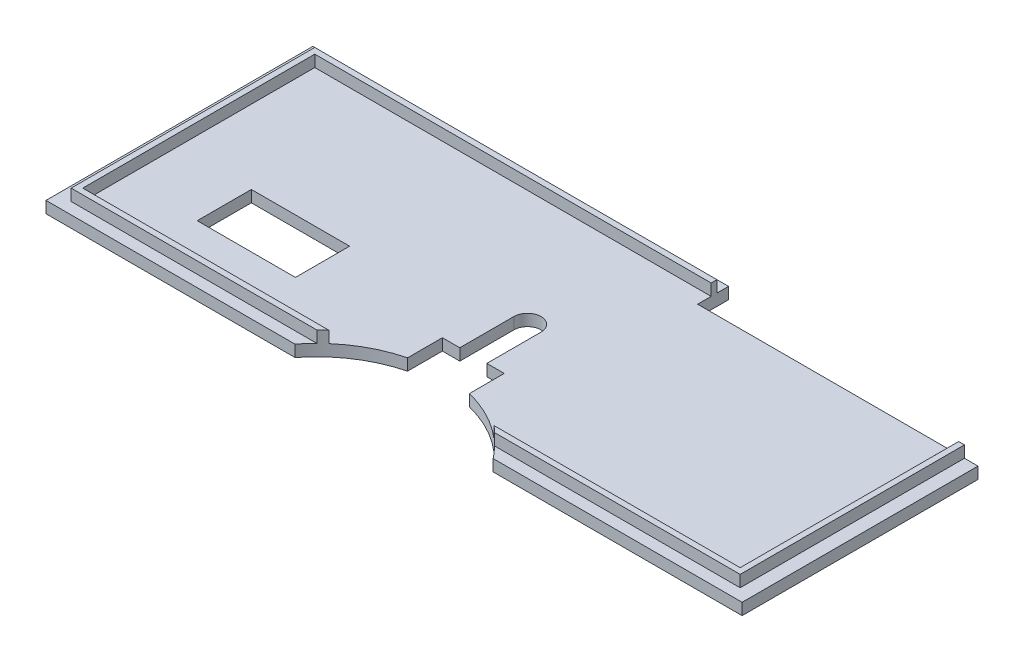
ISO-10303-21;
HEADER;
FILE_DESCRIPTION(('STEP AP214'),'2;1');
FILE_NAME('part.step','',(''),(''),'','','');
FILE_SCHEMA(('AUTOMOTIVE_DESIGN { 1 0 10303 214 1 1 1 1 }'));
ENDSEC;
DATA;
#1=APPLICATION_CONTEXT('core data for automotive mechanical design processes');
#2=APPLICATION_PROTOCOL_DEFINITION('international standard','automotive_design',2000,#1);
#3=PRODUCT_CONTEXT('',#1,'mechanical');
#4=PRODUCT('Part','Part','',(#3));
#5=PRODUCT_RELATED_PRODUCT_CATEGORY('part','',(#4));
#6=PRODUCT_DEFINITION_FORMATION('','',#4);
#7=PRODUCT_DEFINITION_CONTEXT('part definition',#1,'design');
#8=PRODUCT_DEFINITION('design','',#6,#7);
#9=PRODUCT_DEFINITION_SHAPE('','',#8);
#10=(LENGTH_UNIT() NAMED_UNIT(*) SI_UNIT(.MILLI.,.METRE.));
#11=(NAMED_UNIT(*) PLANE_ANGLE_UNIT() SI_UNIT($,.RADIAN.));
#12=(NAMED_UNIT(*) SI_UNIT($,.STERADIAN.) SOLID_ANGLE_UNIT());
#13=UNCERTAINTY_MEASURE_WITH_UNIT(LENGTH_MEASURE(1.E-05),#10,'distance_accuracy_value','');
#14=(GEOMETRIC_REPRESENTATION_CONTEXT(3) GLOBAL_UNCERTAINTY_ASSIGNED_CONTEXT((#13)) GLOBAL_UNIT_ASSIGNED_CONTEXT((#10,
#11,#12)) REPRESENTATION_CONTEXT('',''));
#15=CARTESIAN_POINT('',(0.,0.,0.));
#16=DIRECTION('',(0.,0.,1.));
#17=DIRECTION('',(1.,0.,0.));
#18=AXIS2_PLACEMENT_3D('',#15,#16,#17);
#19=CARTESIAN_POINT('',(8.,10.,14.));
#20=DIRECTION('',(0.,0.,-1.));
#21=DIRECTION('',(-1.,0.,0.));
#22=AXIS2_PLACEMENT_3D('',#19,#20,#21);
#23=PLANE('',#22);
#24=DIRECTION('',(1.,0.,0.));
#25=VECTOR('',#24,1.);
#26=CARTESIAN_POINT('',(8.,0.,14.));
#27=LINE('',#26,#25);
#28=CARTESIAN_POINT('',(-8.,0.,14.));
#29=VERTEX_POINT('',#28);
#30=CARTESIAN_POINT('',(-3.5,0.,14.));
#31=VERTEX_POINT('',#30);
#32=EDGE_CURVE('E525',#29,#31,#27,.T.);
#33=ORIENTED_EDGE('',*,*,#32,.T.);
#34=DIRECTION('',(0.,1.,0.));
#35=VECTOR('',#34,1.);
#36=CARTESIAN_POINT('',(-3.5,10.,14.));
#37=LINE('',#36,#35);
#38=CARTESIAN_POINT('',(-3.5,3.,14.));
#39=VERTEX_POINT('',#38);
#40=EDGE_CURVE('E11',#31,#39,#37,.T.);
#41=ORIENTED_EDGE('',*,*,#40,.T.);
#42=DIRECTION('',(1.,0.,0.));
#43=VECTOR('',#42,1.);
#44=CARTESIAN_POINT('',(0.,3.,14.));
#45=LINE('',#44,#43);
#46=CARTESIAN_POINT('',(-8.,3.,14.));
#47=VERTEX_POINT('',#46);
#48=EDGE_CURVE('E506',#47,#39,#45,.T.);
#49=ORIENTED_EDGE('',*,*,#48,.F.);
#50=DIRECTION('',(0.,-1.,0.));
#51=VECTOR('',#50,1.);
#52=CARTESIAN_POINT('',(-8.,10.,14.));
#53=LINE('',#52,#51);
#54=EDGE_CURVE('E537',#47,#29,#53,.T.);
#55=ORIENTED_EDGE('',*,*,#54,.T.);
#56=EDGE_LOOP('',(#33,#41,#49,#55));
#57=FACE_BOUND('',#56,.T.);
#58=ADVANCED_FACE('F43',(#57),#23,.F.);
#59=CARTESIAN_POINT('',(0.,3.,0.));
#60=DIRECTION('',(0.,-1.,0.));
#61=DIRECTION('',(0.,0.,-1.));
#62=AXIS2_PLACEMENT_3D('',#59,#60,#61);
#63=PLANE('',#62);
#64=DIRECTION('',(0.,0.,-1.));
#65=VECTOR('',#64,1.);
#66=CARTESIAN_POINT('',(90.,3.,-34.5));
#67=LINE('',#66,#65);
#68=CARTESIAN_POINT('',(90.,3.,34.5));
#69=VERTEX_POINT('',#68);
#70=CARTESIAN_POINT('',(90.,3.,-26.5));
#71=VERTEX_POINT('',#70);
#72=EDGE_CURVE('E443',#69,#71,#67,.T.);
#73=ORIENTED_EDGE('',*,*,#72,.T.);
#74=DIRECTION('',(1.,0.,0.));
#75=VECTOR('',#74,1.);
#76=CARTESIAN_POINT('',(90.,3.,-26.5));
#77=LINE('',#76,#75);
#78=CARTESIAN_POINT('',(86.5,3.,-26.5));
#79=VERTEX_POINT('',#78);
#80=EDGE_CURVE('E625',#79,#71,#77,.T.);
#81=ORIENTED_EDGE('',*,*,#80,.F.);
#82=DIRECTION('',(0.,0.,-1.));
#83=VECTOR('',#82,1.);
#84=CARTESIAN_POINT('',(86.5,3.,-31.5));
#85=LINE('',#84,#83);
#86=CARTESIAN_POINT('',(86.5,3.,31.5));
#87=VERTEX_POINT('',#86);
#88=EDGE_CURVE('E415',#87,#79,#85,.T.);
#89=ORIENTED_EDGE('',*,*,#88,.F.);
#90=DIRECTION('',(1.,0.,0.));
#91=VECTOR('',#90,1.);
#92=CARTESIAN_POINT('',(86.5,3.,31.5));
#93=LINE('',#92,#91);
#94=CARTESIAN_POINT('',(22.96192500641,3.,31.5));
#95=VERTEX_POINT('',#94);
#96=EDGE_CURVE('E410',#95,#87,#93,.T.);
#97=ORIENTED_EDGE('',*,*,#96,.F.);
#98=CARTESIAN_POINT('',(0.,3.,54.5));
#99=DIRECTION('',(0.,-1.,0.));
#100=DIRECTION('',(0.,0.,-1.));
#101=AXIS2_PLACEMENT_3D('',#98,#99,#100);
#102=CIRCLE('',#101,32.5);
#103=CARTESIAN_POINT('',(25.617376914899,3.,34.5));
#104=VERTEX_POINT('',#103);
#105=EDGE_CURVE('E294',#95,#104,#102,.T.);
#106=ORIENTED_EDGE('',*,*,#105,.T.);
#107=DIRECTION('',(1.,0.,0.));
#108=VECTOR('',#107,1.);
#109=CARTESIAN_POINT('',(90.,3.,34.5));
#110=LINE('',#109,#108);
#111=EDGE_CURVE('E437',#104,#69,#110,.T.);
#112=ORIENTED_EDGE('',*,*,#111,.T.);
#113=EDGE_LOOP('',(#73,#81,#89,#97,#106,#112));
#114=FACE_BOUND('',#113,.T.);
#115=ADVANCED_FACE('F623',(#114),#63,.F.);
#116=DIRECTION('',(0.,0.,-1.));
#117=VECTOR('',#116,1.);
#118=CARTESIAN_POINT('',(-40.5,3.,0.));
#119=LINE('',#118,#117);
#120=CARTESIAN_POINT('',(-40.5,3.,19.5));
#121=VERTEX_POINT('',#120);
#122=CARTESIAN_POINT('',(-40.5,3.,5.50000000000001));
#123=VERTEX_POINT('',#122);
#124=EDGE_CURVE('E487',#121,#123,#119,.T.);
#125=ORIENTED_EDGE('',*,*,#124,.F.);
#126=DIRECTION('',(-1.,0.,0.));
#127=VECTOR('',#126,1.);
#128=CARTESIAN_POINT('',(0.,3.,19.5));
#129=LINE('',#128,#127);
#130=CARTESIAN_POINT('',(-65.9,3.,19.5));
#131=VERTEX_POINT('',#130);
#132=EDGE_CURVE('E476',#121,#131,#129,.T.);
#133=ORIENTED_EDGE('',*,*,#132,.T.);
#134=DIRECTION('',(0.,0.,-1.));
#135=VECTOR('',#134,1.);
#136=CARTESIAN_POINT('',(-65.9,3.,0.));
#137=LINE('',#136,#135);
#138=CARTESIAN_POINT('',(-65.9,3.,5.50000000000001));
#139=VERTEX_POINT('',#138);
#140=EDGE_CURVE('E480',#131,#139,#137,.T.);
#141=ORIENTED_EDGE('',*,*,#140,.T.);
#142=DIRECTION('',(-1.,0.,0.));
#143=VECTOR('',#142,1.);
#144=CARTESIAN_POINT('',(0.,3.,5.5));
#145=LINE('',#144,#143);
#146=EDGE_CURVE('E484',#123,#139,#145,.T.);
#147=ORIENTED_EDGE('',*,*,#146,.F.);
#148=EDGE_LOOP('',(#125,#133,#141,#147));
#149=FACE_BOUND('',#148,.T.);
#150=ORIENTED_EDGE('',*,*,#48,.T.);
#151=DIRECTION('',(0.,0.,-1.));
#152=VECTOR('',#151,1.);
#153=CARTESIAN_POINT('',(-3.5,3.,0.));
#154=LINE('',#153,#152);
#155=CARTESIAN_POINT('',(-3.5,3.,0.));
#156=VERTEX_POINT('',#155);
#157=EDGE_CURVE('E59',#39,#156,#154,.T.);
#158=ORIENTED_EDGE('',*,*,#157,.T.);
#159=CARTESIAN_POINT('',(0.,3.,0.));
#160=DIRECTION('',(0.,-1.,0.));
#161=DIRECTION('',(0.,0.,-1.));
#162=AXIS2_PLACEMENT_3D('',#159,#160,#161);
#163=CIRCLE('',#162,3.5);
#164=CARTESIAN_POINT('',(3.5,3.,0.));
#165=VERTEX_POINT('',#164);
#166=EDGE_CURVE('E279',#156,#165,#163,.T.);
#167=ORIENTED_EDGE('',*,*,#166,.T.);
#168=DIRECTION('',(0.,0.,1.));
#169=VECTOR('',#168,1.);
#170=CARTESIAN_POINT('',(3.5,3.,0.));
#171=LINE('',#170,#169);
#172=CARTESIAN_POINT('',(3.5,3.,14.));
#173=VERTEX_POINT('',#172);
#174=EDGE_CURVE('E608',#165,#173,#171,.T.);
#175=ORIENTED_EDGE('',*,*,#174,.T.);
#176=CARTESIAN_POINT('',(8.,3.,14.));
#177=VERTEX_POINT('',#176);
#178=EDGE_CURVE('E505',#173,#177,#45,.T.);
#179=ORIENTED_EDGE('',*,*,#178,.T.);
#180=DIRECTION('',(0.,0.,1.));
#181=VECTOR('',#180,1.);
#182=CARTESIAN_POINT('',(8.,3.,0.));
#183=LINE('',#182,#181);
#184=CARTESIAN_POINT('',(8.,3.,23.));
#185=VERTEX_POINT('',#184);
#186=EDGE_CURVE('E541',#177,#185,#183,.T.);
#187=ORIENTED_EDGE('',*,*,#186,.T.);
#188=CARTESIAN_POINT('',(21.3541565040626,3.,30.));
#189=VERTEX_POINT('',#188);
#190=EDGE_CURVE('E560',#185,#189,#102,.T.);
#191=ORIENTED_EDGE('',*,*,#190,.T.);
#192=DIRECTION('',(1.,0.,0.));
#193=VECTOR('',#192,1.);
#194=CARTESIAN_POINT('',(85.,3.,30.));
#195=LINE('',#194,#193);
#196=CARTESIAN_POINT('',(85.,3.,30.));
#197=VERTEX_POINT('',#196);
#198=EDGE_CURVE('E366',#189,#197,#195,.T.);
#199=ORIENTED_EDGE('',*,*,#198,.T.);
#200=DIRECTION('',(0.,0.,-1.));
#201=VECTOR('',#200,1.);
#202=CARTESIAN_POINT('',(85.,3.,-30.));
#203=LINE('',#202,#201);
#204=CARTESIAN_POINT('',(85.,3.,-26.5));
#205=VERTEX_POINT('',#204);
#206=EDGE_CURVE('E371',#197,#205,#203,.T.);
#207=ORIENTED_EDGE('',*,*,#206,.T.);
#208=CARTESIAN_POINT('',(17.5,3.,-26.5));
#209=VERTEX_POINT('',#208);
#210=EDGE_CURVE('E629',#209,#205,#77,.T.);
#211=ORIENTED_EDGE('',*,*,#210,.F.);
#212=DIRECTION('',(0.,0.,1.));
#213=VECTOR('',#212,1.);
#214=CARTESIAN_POINT('',(17.5,3.,-34.5));
#215=LINE('',#214,#213);
#216=CARTESIAN_POINT('',(17.5,3.,-30.));
#217=VERTEX_POINT('',#216);
#218=EDGE_CURVE('E650',#217,#209,#215,.T.);
#219=ORIENTED_EDGE('',*,*,#218,.F.);
#220=DIRECTION('',(-1.,0.,0.));
#221=VECTOR('',#220,1.);
#222=CARTESIAN_POINT('',(85.,3.,-30.));
#223=LINE('',#222,#221);
#224=CARTESIAN_POINT('',(-85.,3.,-30.));
#225=VERTEX_POINT('',#224);
#226=EDGE_CURVE('E350',#217,#225,#223,.T.);
#227=ORIENTED_EDGE('',*,*,#226,.T.);
#228=DIRECTION('',(0.,0.,1.));
#229=VECTOR('',#228,1.);
#230=CARTESIAN_POINT('',(-85.,3.,-30.));
#231=LINE('',#230,#229);
#232=CARTESIAN_POINT('',(-85.,3.,30.));
#233=VERTEX_POINT('',#232);
#234=EDGE_CURVE('E336',#225,#233,#231,.T.);
#235=ORIENTED_EDGE('',*,*,#234,.T.);
#236=CARTESIAN_POINT('',(-21.3541565040626,3.,30.));
#237=VERTEX_POINT('',#236);
#238=EDGE_CURVE('E367',#233,#237,#195,.T.);
#239=ORIENTED_EDGE('',*,*,#238,.T.);
#240=CARTESIAN_POINT('',(-8.,3.,23.));
#241=VERTEX_POINT('',#240);
#242=EDGE_CURVE('E562',#237,#241,#102,.T.);
#243=ORIENTED_EDGE('',*,*,#242,.T.);
#244=DIRECTION('',(0.,0.,-1.));
#245=VECTOR('',#244,1.);
#246=CARTESIAN_POINT('',(-8.,3.,0.));
#247=LINE('',#246,#245);
#248=EDGE_CURVE('E547',#241,#47,#247,.T.);
#249=ORIENTED_EDGE('',*,*,#248,.T.);
#250=EDGE_LOOP('',(#150,#158,#167,#175,#179,#187,#191,#199,#207,#211,#219,#227,#235,#239,#243,#249));
#251=FACE_BOUND('',#250,.T.);
#252=ADVANCED_FACE('F589',(#149,#251),#63,.F.);
#253=CARTESIAN_POINT('',(0.,10.,54.5));
#254=DIRECTION('',(0.,-1.,0.));
#255=DIRECTION('',(0.,0.,-1.));
#256=AXIS2_PLACEMENT_3D('',#253,#254,#255);
#257=CYLINDRICAL_SURFACE('',#256,32.5);
#258=CARTESIAN_POINT('',(0.,0.,54.5));
#259=DIRECTION('',(0.,-1.,0.));
#260=DIRECTION('',(0.,0.,-1.));
#261=AXIS2_PLACEMENT_3D('',#258,#259,#260);
#262=CIRCLE('',#261,32.5);
#263=CARTESIAN_POINT('',(-25.617376914899,0.,34.5));
#264=VERTEX_POINT('',#263);
#265=CARTESIAN_POINT('',(-8.,0.,23.));
#266=VERTEX_POINT('',#265);
#267=EDGE_CURVE('E552',#264,#266,#262,.T.);
#268=ORIENTED_EDGE('',*,*,#267,.T.);
#269=DIRECTION('',(0.,-1.,0.));
#270=VECTOR('',#269,1.);
#271=CARTESIAN_POINT('',(-8.,10.,23.));
#272=LINE('',#271,#270);
#273=EDGE_CURVE('E501',#266,#241,#272,.F.);
#274=ORIENTED_EDGE('',*,*,#273,.T.);
#275=ORIENTED_EDGE('',*,*,#242,.F.);
#276=DIRECTION('',(0.,-1.,0.));
#277=VECTOR('',#276,1.);
#278=CARTESIAN_POINT('',(-21.3541565040626,10.,30.));
#279=LINE('',#278,#277);
#280=CARTESIAN_POINT('',(-21.3541565040626,6.,30.));
#281=VERTEX_POINT('',#280);
#282=EDGE_CURVE('E490',#237,#281,#279,.F.);
#283=ORIENTED_EDGE('',*,*,#282,.T.);
#284=CARTESIAN_POINT('',(0.,6.,54.5));
#285=DIRECTION('',(0.,-1.,0.));
#286=DIRECTION('',(0.,0.,-1.));
#287=AXIS2_PLACEMENT_3D('',#284,#285,#286);
#288=CIRCLE('',#287,32.5);
#289=CARTESIAN_POINT('',(-22.96192500641,6.,31.5));
#290=VERTEX_POINT('',#289);
#291=EDGE_CURVE('E556',#290,#281,#288,.T.);
#292=ORIENTED_EDGE('',*,*,#291,.F.);
#293=DIRECTION('',(0.,-1.,0.));
#294=VECTOR('',#293,1.);
#295=CARTESIAN_POINT('',(-22.9619250064101,10.,31.5));
#296=LINE('',#295,#294);
#297=CARTESIAN_POINT('',(-22.9619250064101,3.,31.5));
#298=VERTEX_POINT('',#297);
#299=EDGE_CURVE('E566',#298,#290,#296,.F.);
#300=ORIENTED_EDGE('',*,*,#299,.F.);
#301=CARTESIAN_POINT('',(-25.617376914899,3.,34.5));
#302=VERTEX_POINT('',#301);
#303=EDGE_CURVE('E567',#302,#298,#102,.T.);
#304=ORIENTED_EDGE('',*,*,#303,.F.);
#305=DIRECTION('',(0.,-1.,0.));
#306=VECTOR('',#305,1.);
#307=CARTESIAN_POINT('',(-25.617376914899,10.,34.5));
#308=LINE('',#307,#306);
#309=EDGE_CURVE('E575',#264,#302,#308,.F.);
#310=ORIENTED_EDGE('',*,*,#309,.F.);
#311=EDGE_LOOP('',(#268,#274,#275,#283,#292,#300,#304,#310));
#312=FACE_BOUND('',#311,.T.);
#313=ADVANCED_FACE('F717',(#312),#257,.F.);
#314=CARTESIAN_POINT('',(90.,3.,34.5));
#315=DIRECTION('',(0.,0.,-1.));
#316=DIRECTION('',(-1.,0.,0.));
#317=AXIS2_PLACEMENT_3D('',#314,#315,#316);
#318=PLANE('',#317);
#319=ORIENTED_EDGE('',*,*,#111,.F.);
#320=DIRECTION('',(0.,-1.,0.));
#321=VECTOR('',#320,1.);
#322=CARTESIAN_POINT('',(25.617376914899,10.,34.5));
#323=LINE('',#322,#321);
#324=CARTESIAN_POINT('',(25.617376914899,0.,34.5));
#325=VERTEX_POINT('',#324);
#326=EDGE_CURVE('E287',#104,#325,#323,.T.);
#327=ORIENTED_EDGE('',*,*,#326,.T.);
#328=DIRECTION('',(1.,0.,0.));
#329=VECTOR('',#328,1.);
#330=CARTESIAN_POINT('',(90.,0.,34.5));
#331=LINE('',#330,#329);
#332=CARTESIAN_POINT('',(90.,0.,34.5));
#333=VERTEX_POINT('',#332);
#334=EDGE_CURVE('E454',#325,#333,#331,.T.);
#335=ORIENTED_EDGE('',*,*,#334,.T.);
#336=DIRECTION('',(0.,-1.,0.));
#337=VECTOR('',#336,1.);
#338=CARTESIAN_POINT('',(90.,3.,34.5));
#339=LINE('',#338,#337);
#340=EDGE_CURVE('E468',#69,#333,#339,.T.);
#341=ORIENTED_EDGE('',*,*,#340,.F.);
#342=EDGE_LOOP('',(#319,#327,#335,#341));
#343=FACE_BOUND('',#342,.T.);
#344=ADVANCED_FACE('F617',(#343),#318,.F.);
#345=CARTESIAN_POINT('',(0.,6.,0.));
#346=DIRECTION('',(0.,-1.,0.));
#347=DIRECTION('',(0.,0.,-1.));
#348=AXIS2_PLACEMENT_3D('',#345,#346,#347);
#349=PLANE('',#348);
#350=DIRECTION('',(1.,0.,0.));
#351=VECTOR('',#350,1.);
#352=CARTESIAN_POINT('',(85.,6.,30.));
#353=LINE('',#352,#351);
#354=CARTESIAN_POINT('',(21.3541565040626,6.,30.));
#355=VERTEX_POINT('',#354);
#356=CARTESIAN_POINT('',(85.,6.,30.));
#357=VERTEX_POINT('',#356);
#358=EDGE_CURVE('E349',#355,#357,#353,.T.);
#359=ORIENTED_EDGE('',*,*,#358,.F.);
#360=CARTESIAN_POINT('',(22.96192500641,6.,31.5));
#361=VERTEX_POINT('',#360);
#362=EDGE_CURVE('E561',#355,#361,#288,.T.);
#363=ORIENTED_EDGE('',*,*,#362,.T.);
#364=DIRECTION('',(1.,0.,0.));
#365=VECTOR('',#364,1.);
#366=CARTESIAN_POINT('',(86.5,6.,31.5));
#367=LINE('',#366,#365);
#368=CARTESIAN_POINT('',(86.5,6.,31.5));
#369=VERTEX_POINT('',#368);
#370=EDGE_CURVE('E393',#361,#369,#367,.T.);
#371=ORIENTED_EDGE('',*,*,#370,.T.);
#372=DIRECTION('',(0.,0.,-1.));
#373=VECTOR('',#372,1.);
#374=CARTESIAN_POINT('',(86.5,6.,-31.5));
#375=LINE('',#374,#373);
#376=CARTESIAN_POINT('',(86.5,6.,-26.5));
#377=VERTEX_POINT('',#376);
#378=EDGE_CURVE('E399',#369,#377,#375,.T.);
#379=ORIENTED_EDGE('',*,*,#378,.T.);
#380=DIRECTION('',(1.,0.,0.));
#381=VECTOR('',#380,1.);
#382=CARTESIAN_POINT('',(86.5,6.,-26.5));
#383=LINE('',#382,#381);
#384=CARTESIAN_POINT('',(85.,6.,-26.5));
#385=VERTEX_POINT('',#384);
#386=EDGE_CURVE('E291',#385,#377,#383,.T.);
#387=ORIENTED_EDGE('',*,*,#386,.F.);
#388=DIRECTION('',(0.,0.,-1.));
#389=VECTOR('',#388,1.);
#390=CARTESIAN_POINT('',(85.,6.,-30.));
#391=LINE('',#390,#389);
#392=EDGE_CURVE('E355',#357,#385,#391,.T.);
#393=ORIENTED_EDGE('',*,*,#392,.F.);
#394=EDGE_LOOP('',(#359,#363,#371,#379,#387,#393));
#395=FACE_BOUND('',#394,.T.);
#396=ADVANCED_FACE('F642',(#395),#349,.F.);
#397=CARTESIAN_POINT('',(86.5,6.,31.5));
#398=DIRECTION('',(0.,0.,-1.));
#399=DIRECTION('',(-1.,0.,0.));
#400=AXIS2_PLACEMENT_3D('',#397,#398,#399);
#401=PLANE('',#400);
#402=ORIENTED_EDGE('',*,*,#370,.F.);
#403=DIRECTION('',(0.,-1.,0.));
#404=VECTOR('',#403,1.);
#405=CARTESIAN_POINT('',(22.96192500641,10.,31.5));
#406=LINE('',#405,#404);
#407=EDGE_CURVE('E571',#361,#95,#406,.T.);
#408=ORIENTED_EDGE('',*,*,#407,.T.);
#409=ORIENTED_EDGE('',*,*,#96,.T.);
#410=DIRECTION('',(0.,-1.,0.));
#411=VECTOR('',#410,1.);
#412=CARTESIAN_POINT('',(86.5,6.,31.5));
#413=LINE('',#412,#411);
#414=EDGE_CURVE('E424',#369,#87,#413,.T.);
#415=ORIENTED_EDGE('',*,*,#414,.F.);
#416=EDGE_LOOP('',(#402,#408,#409,#415));
#417=FACE_BOUND('',#416,.T.);
#418=ADVANCED_FACE('F640',(#417),#401,.F.);
#419=CARTESIAN_POINT('',(85.,6.,30.));
#420=DIRECTION('',(0.,0.,-1.));
#421=DIRECTION('',(-1.,0.,0.));
#422=AXIS2_PLACEMENT_3D('',#419,#420,#421);
#423=PLANE('',#422);
#424=DIRECTION('',(0.,-1.,0.));
#425=VECTOR('',#424,1.);
#426=CARTESIAN_POINT('',(21.3541565040626,10.,30.));
#427=LINE('',#426,#425);
#428=EDGE_CURVE('E493',#355,#189,#427,.T.);
#429=ORIENTED_EDGE('',*,*,#428,.F.);
#430=ORIENTED_EDGE('',*,*,#358,.T.);
#431=DIRECTION('',(0.,-1.,0.));
#432=VECTOR('',#431,1.);
#433=CARTESIAN_POINT('',(85.,6.,30.));
#434=LINE('',#433,#432);
#435=EDGE_CURVE('E380',#357,#197,#434,.T.);
#436=ORIENTED_EDGE('',*,*,#435,.T.);
#437=ORIENTED_EDGE('',*,*,#198,.F.);
#438=EDGE_LOOP('',(#429,#430,#436,#437));
#439=FACE_BOUND('',#438,.T.);
#440=ADVANCED_FACE('F598',(#439),#423,.T.);
#441=CARTESIAN_POINT('',(0.,0.,0.));
#442=DIRECTION('',(0.,-1.,0.));
#443=DIRECTION('',(0.,0.,-1.));
#444=AXIS2_PLACEMENT_3D('',#441,#442,#443);
#445=PLANE('',#444);
#446=DIRECTION('',(0.,0.,-1.));
#447=VECTOR('',#446,1.);
#448=CARTESIAN_POINT('',(-3.5,0.,0.));
#449=LINE('',#448,#447);
#450=CARTESIAN_POINT('',(-3.5,0.,0.));
#451=VERTEX_POINT('',#450);
#452=EDGE_CURVE('E262',#31,#451,#449,.T.);
#453=ORIENTED_EDGE('',*,*,#452,.F.);
#454=ORIENTED_EDGE('',*,*,#32,.F.);
#455=DIRECTION('',(0.,0.,-1.));
#456=VECTOR('',#455,1.);
#457=CARTESIAN_POINT('',(-8.,0.,30.));
#458=LINE('',#457,#456);
#459=EDGE_CURVE('E526',#266,#29,#458,.T.);
#460=ORIENTED_EDGE('',*,*,#459,.F.);
#461=ORIENTED_EDGE('',*,*,#267,.F.);
#462=CARTESIAN_POINT('',(-90.,0.,34.5));
#463=VERTEX_POINT('',#462);
#464=EDGE_CURVE('E455',#463,#264,#331,.T.);
#465=ORIENTED_EDGE('',*,*,#464,.F.);
#466=DIRECTION('',(0.,0.,1.));
#467=VECTOR('',#466,1.);
#468=CARTESIAN_POINT('',(-90.,0.,-34.5));
#469=LINE('',#468,#467);
#470=CARTESIAN_POINT('',(-90.,0.,-34.5));
#471=VERTEX_POINT('',#470);
#472=EDGE_CURVE('E432',#471,#463,#469,.T.);
#473=ORIENTED_EDGE('',*,*,#472,.F.);
#474=DIRECTION('',(-1.,0.,0.));
#475=VECTOR('',#474,1.);
#476=CARTESIAN_POINT('',(90.,0.,-34.5));
#477=LINE('',#476,#475);
#478=CARTESIAN_POINT('',(17.5,0.,-34.5));
#479=VERTEX_POINT('',#478);
#480=EDGE_CURVE('E438',#479,#471,#477,.T.);
#481=ORIENTED_EDGE('',*,*,#480,.F.);
#482=DIRECTION('',(0.,0.,-1.));
#483=VECTOR('',#482,1.);
#484=CARTESIAN_POINT('',(17.5,0.,0.));
#485=LINE('',#484,#483);
#486=CARTESIAN_POINT('',(17.5,0.,-26.5));
#487=VERTEX_POINT('',#486);
#488=EDGE_CURVE('E660',#487,#479,#485,.T.);
#489=ORIENTED_EDGE('',*,*,#488,.F.);
#490=DIRECTION('',(-1.,0.,0.));
#491=VECTOR('',#490,1.);
#492=CARTESIAN_POINT('',(0.,0.,-26.5));
#493=LINE('',#492,#491);
#494=CARTESIAN_POINT('',(90.,0.,-26.5));
#495=VERTEX_POINT('',#494);
#496=EDGE_CURVE('E531',#495,#487,#493,.T.);
#497=ORIENTED_EDGE('',*,*,#496,.F.);
#498=DIRECTION('',(0.,0.,-1.));
#499=VECTOR('',#498,1.);
#500=CARTESIAN_POINT('',(90.,0.,-34.5));
#501=LINE('',#500,#499);
#502=EDGE_CURVE('E459',#333,#495,#501,.T.);
#503=ORIENTED_EDGE('',*,*,#502,.F.);
#504=ORIENTED_EDGE('',*,*,#334,.F.);
#505=CARTESIAN_POINT('',(8.,0.,23.));
#506=VERTEX_POINT('',#505);
#507=EDGE_CURVE('E551',#506,#325,#262,.T.);
#508=ORIENTED_EDGE('',*,*,#507,.F.);
#509=DIRECTION('',(0.,0.,1.));
#510=VECTOR('',#509,1.);
#511=CARTESIAN_POINT('',(8.,0.,30.));
#512=LINE('',#511,#510);
#513=CARTESIAN_POINT('',(8.,0.,14.));
#514=VERTEX_POINT('',#513);
#515=EDGE_CURVE('E523',#514,#506,#512,.T.);
#516=ORIENTED_EDGE('',*,*,#515,.F.);
#517=CARTESIAN_POINT('',(3.5,0.,14.));
#518=VERTEX_POINT('',#517);
#519=EDGE_CURVE('E518',#518,#514,#27,.T.);
#520=ORIENTED_EDGE('',*,*,#519,.F.);
#521=DIRECTION('',(0.,0.,1.));
#522=VECTOR('',#521,1.);
#523=CARTESIAN_POINT('',(3.5,0.,0.));
#524=LINE('',#523,#522);
#525=CARTESIAN_POINT('',(3.5,0.,0.));
#526=VERTEX_POINT('',#525);
#527=EDGE_CURVE('E66',#526,#518,#524,.T.);
#528=ORIENTED_EDGE('',*,*,#527,.F.);
#529=CARTESIAN_POINT('',(0.,0.,0.));
#530=DIRECTION('',(0.,-1.,0.));
#531=DIRECTION('',(0.,0.,-1.));
#532=AXIS2_PLACEMENT_3D('',#529,#530,#531);
#533=CIRCLE('',#532,3.5);
#534=EDGE_CURVE('E277',#451,#526,#533,.T.);
#535=ORIENTED_EDGE('',*,*,#534,.F.);
#536=EDGE_LOOP('',(#453,#454,#460,#461,#465,#473,#481,#489,#497,#503,#504,#508,#516,#520,#528,#535));
#537=FACE_BOUND('',#536,.T.);
#538=DIRECTION('',(-1.,0.,0.));
#539=VECTOR('',#538,1.);
#540=CARTESIAN_POINT('',(0.,0.,19.5));
#541=LINE('',#540,#539);
#542=CARTESIAN_POINT('',(-40.5,0.,19.5));
#543=VERTEX_POINT('',#542);
#544=CARTESIAN_POINT('',(-65.9,0.,19.5));
#545=VERTEX_POINT('',#544);
#546=EDGE_CURVE('E320',#543,#545,#541,.T.);
#547=ORIENTED_EDGE('',*,*,#546,.F.);
#548=DIRECTION('',(0.,0.,-1.));
#549=VECTOR('',#548,1.);
#550=CARTESIAN_POINT('',(-40.5,0.,0.));
#551=LINE('',#550,#549);
#552=CARTESIAN_POINT('',(-40.5,0.,5.50000000000001));
#553=VERTEX_POINT('',#552);
#554=EDGE_CURVE('E314',#543,#553,#551,.T.);
#555=ORIENTED_EDGE('',*,*,#554,.T.);
#556=DIRECTION('',(-1.,0.,0.));
#557=VECTOR('',#556,1.);
#558=CARTESIAN_POINT('',(0.,0.,5.5));
#559=LINE('',#558,#557);
#560=CARTESIAN_POINT('',(-65.9,0.,5.50000000000001));
#561=VERTEX_POINT('',#560);
#562=EDGE_CURVE('E328',#553,#561,#559,.T.);
#563=ORIENTED_EDGE('',*,*,#562,.T.);
#564=DIRECTION('',(0.,0.,-1.));
#565=VECTOR('',#564,1.);
#566=CARTESIAN_POINT('',(-65.9,0.,0.));
#567=LINE('',#566,#565);
#568=EDGE_CURVE('E324',#545,#561,#567,.T.);
#569=ORIENTED_EDGE('',*,*,#568,.F.);
#570=EDGE_LOOP('',(#547,#555,#563,#569));
#571=FACE_BOUND('',#570,.T.);
#572=ADVANCED_FACE('F283',(#537,#571),#445,.T.);
#573=DIRECTION('',(-1.,0.,0.));
#574=VECTOR('',#573,1.);
#575=CARTESIAN_POINT('',(86.5,3.,-31.5));
#576=LINE('',#575,#574);
#577=CARTESIAN_POINT('',(17.5,3.,-31.5));
#578=VERTEX_POINT('',#577);
#579=CARTESIAN_POINT('',(-86.5,3.,-31.5));
#580=VERTEX_POINT('',#579);
#581=EDGE_CURVE('E394',#578,#580,#576,.T.);
#582=ORIENTED_EDGE('',*,*,#581,.F.);
#583=CARTESIAN_POINT('',(17.5,3.,-34.5));
#584=VERTEX_POINT('',#583);
#585=EDGE_CURVE('E630',#584,#578,#215,.T.);
#586=ORIENTED_EDGE('',*,*,#585,.F.);
#587=DIRECTION('',(-1.,0.,0.));
#588=VECTOR('',#587,1.);
#589=CARTESIAN_POINT('',(90.,3.,-34.5));
#590=LINE('',#589,#588);
#591=CARTESIAN_POINT('',(-90.,3.,-34.5));
#592=VERTEX_POINT('',#591);
#593=EDGE_CURVE('E447',#584,#592,#590,.T.);
#594=ORIENTED_EDGE('',*,*,#593,.T.);
#595=DIRECTION('',(0.,0.,1.));
#596=VECTOR('',#595,1.);
#597=CARTESIAN_POINT('',(-90.,3.,-34.5));
#598=LINE('',#597,#596);
#599=CARTESIAN_POINT('',(-90.,3.,34.5));
#600=VERTEX_POINT('',#599);
#601=EDGE_CURVE('E433',#592,#600,#598,.T.);
#602=ORIENTED_EDGE('',*,*,#601,.T.);
#603=EDGE_CURVE('E439',#600,#302,#110,.T.);
#604=ORIENTED_EDGE('',*,*,#603,.T.);
#605=ORIENTED_EDGE('',*,*,#303,.T.);
#606=CARTESIAN_POINT('',(-86.5,3.,31.5));
#607=VERTEX_POINT('',#606);
#608=EDGE_CURVE('E411',#607,#298,#93,.T.);
#609=ORIENTED_EDGE('',*,*,#608,.F.);
#610=DIRECTION('',(0.,0.,1.));
#611=VECTOR('',#610,1.);
#612=CARTESIAN_POINT('',(-86.5,3.,-31.5));
#613=LINE('',#612,#611);
#614=EDGE_CURVE('E388',#580,#607,#613,.T.);
#615=ORIENTED_EDGE('',*,*,#614,.F.);
#616=EDGE_LOOP('',(#582,#586,#594,#602,#604,#605,#609,#615));
#617=FACE_BOUND('',#616,.T.);
#618=ADVANCED_FACE('F679',(#617),#63,.F.);
#619=CARTESIAN_POINT('',(-90.,3.,-34.5));
#620=DIRECTION('',(1.,0.,0.));
#621=DIRECTION('',(0.,0.,-1.));
#622=AXIS2_PLACEMENT_3D('',#619,#620,#621);
#623=PLANE('',#622);
#624=ORIENTED_EDGE('',*,*,#472,.T.);
#625=DIRECTION('',(0.,-1.,0.));
#626=VECTOR('',#625,1.);
#627=CARTESIAN_POINT('',(-90.,3.,34.5));
#628=LINE('',#627,#626);
#629=EDGE_CURVE('E472',#600,#463,#628,.T.);
#630=ORIENTED_EDGE('',*,*,#629,.F.);
#631=ORIENTED_EDGE('',*,*,#601,.F.);
#632=DIRECTION('',(0.,-1.,0.));
#633=VECTOR('',#632,1.);
#634=CARTESIAN_POINT('',(-90.,3.,-34.5));
#635=LINE('',#634,#633);
#636=EDGE_CURVE('E450',#592,#471,#635,.T.);
#637=ORIENTED_EDGE('',*,*,#636,.T.);
#638=EDGE_LOOP('',(#624,#630,#631,#637));
#639=FACE_BOUND('',#638,.T.);
#640=ADVANCED_FACE('F45',(#639),#623,.F.);
#641=ORIENTED_EDGE('',*,*,#464,.T.);
#642=ORIENTED_EDGE('',*,*,#309,.T.);
#643=ORIENTED_EDGE('',*,*,#603,.F.);
#644=ORIENTED_EDGE('',*,*,#629,.T.);
#645=EDGE_LOOP('',(#641,#642,#643,#644));
#646=FACE_BOUND('',#645,.T.);
#647=ADVANCED_FACE('F728',(#646),#318,.F.);
#648=CARTESIAN_POINT('',(90.,3.,-34.5));
#649=DIRECTION('',(-1.,0.,0.));
#650=DIRECTION('',(0.,0.,1.));
#651=AXIS2_PLACEMENT_3D('',#648,#649,#650);
#652=PLANE('',#651);
#653=ORIENTED_EDGE('',*,*,#502,.T.);
#654=DIRECTION('',(0.,1.,0.));
#655=VECTOR('',#654,1.);
#656=CARTESIAN_POINT('',(90.,-7.,-26.5));
#657=LINE('',#656,#655);
#658=EDGE_CURVE('E622',#495,#71,#657,.T.);
#659=ORIENTED_EDGE('',*,*,#658,.T.);
#660=ORIENTED_EDGE('',*,*,#72,.F.);
#661=ORIENTED_EDGE('',*,*,#340,.T.);
#662=EDGE_LOOP('',(#653,#659,#660,#661));
#663=FACE_BOUND('',#662,.T.);
#664=ADVANCED_FACE('F620',(#663),#652,.F.);
#665=CARTESIAN_POINT('',(90.,3.,-34.5));
#666=DIRECTION('',(0.,0.,1.));
#667=DIRECTION('',(1.,0.,0.));
#668=AXIS2_PLACEMENT_3D('',#665,#666,#667);
#669=PLANE('',#668);
#670=ORIENTED_EDGE('',*,*,#593,.F.);
#671=DIRECTION('',(0.,-1.,0.));
#672=VECTOR('',#671,1.);
#673=CARTESIAN_POINT('',(17.5,3.,-34.5));
#674=LINE('',#673,#672);
#675=EDGE_CURVE('E510',#584,#479,#674,.T.);
#676=ORIENTED_EDGE('',*,*,#675,.T.);
#677=ORIENTED_EDGE('',*,*,#480,.T.);
#678=ORIENTED_EDGE('',*,*,#636,.F.);
#679=EDGE_LOOP('',(#670,#676,#677,#678));
#680=FACE_BOUND('',#679,.T.);
#681=ADVANCED_FACE('F673',(#680),#669,.F.);
#682=CARTESIAN_POINT('',(-86.5,6.,31.5));
#683=VERTEX_POINT('',#682);
#684=EDGE_CURVE('E395',#683,#290,#367,.T.);
#685=ORIENTED_EDGE('',*,*,#684,.T.);
#686=ORIENTED_EDGE('',*,*,#291,.T.);
#687=CARTESIAN_POINT('',(-85.,6.,30.));
#688=VERTEX_POINT('',#687);
#689=EDGE_CURVE('E351',#688,#281,#353,.T.);
#690=ORIENTED_EDGE('',*,*,#689,.F.);
#691=DIRECTION('',(0.,0.,1.));
#692=VECTOR('',#691,1.);
#693=CARTESIAN_POINT('',(-85.,6.,-30.));
#694=LINE('',#693,#692);
#695=CARTESIAN_POINT('',(-85.,6.,-30.));
#696=VERTEX_POINT('',#695);
#697=EDGE_CURVE('E346',#696,#688,#694,.T.);
#698=ORIENTED_EDGE('',*,*,#697,.F.);
#699=DIRECTION('',(-1.,0.,0.));
#700=VECTOR('',#699,1.);
#701=CARTESIAN_POINT('',(85.,6.,-30.));
#702=LINE('',#701,#700);
#703=CARTESIAN_POINT('',(17.5,6.,-30.));
#704=VERTEX_POINT('',#703);
#705=EDGE_CURVE('E359',#704,#696,#702,.T.);
#706=ORIENTED_EDGE('',*,*,#705,.F.);
#707=DIRECTION('',(0.,0.,1.));
#708=VECTOR('',#707,1.);
#709=CARTESIAN_POINT('',(17.5,6.,-31.5));
#710=LINE('',#709,#708);
#711=CARTESIAN_POINT('',(17.5,6.,-31.5));
#712=VERTEX_POINT('',#711);
#713=EDGE_CURVE('E304',#712,#704,#710,.T.);
#714=ORIENTED_EDGE('',*,*,#713,.F.);
#715=DIRECTION('',(-1.,0.,0.));
#716=VECTOR('',#715,1.);
#717=CARTESIAN_POINT('',(86.5,6.,-31.5));
#718=LINE('',#717,#716);
#719=CARTESIAN_POINT('',(-86.5,6.,-31.5));
#720=VERTEX_POINT('',#719);
#721=EDGE_CURVE('E403',#712,#720,#718,.T.);
#722=ORIENTED_EDGE('',*,*,#721,.T.);
#723=DIRECTION('',(0.,0.,1.));
#724=VECTOR('',#723,1.);
#725=CARTESIAN_POINT('',(-86.5,6.,-31.5));
#726=LINE('',#725,#724);
#727=EDGE_CURVE('E389',#720,#683,#726,.T.);
#728=ORIENTED_EDGE('',*,*,#727,.T.);
#729=EDGE_LOOP('',(#685,#686,#690,#698,#706,#714,#722,#728));
#730=FACE_BOUND('',#729,.T.);
#731=ADVANCED_FACE('F741',(#730),#349,.F.);
#732=CARTESIAN_POINT('',(-86.5,6.,-31.5));
#733=DIRECTION('',(1.,0.,0.));
#734=DIRECTION('',(0.,0.,-1.));
#735=AXIS2_PLACEMENT_3D('',#732,#733,#734);
#736=PLANE('',#735);
#737=ORIENTED_EDGE('',*,*,#614,.T.);
#738=DIRECTION('',(0.,-1.,0.));
#739=VECTOR('',#738,1.);
#740=CARTESIAN_POINT('',(-86.5,6.,31.5));
#741=LINE('',#740,#739);
#742=EDGE_CURVE('E428',#683,#607,#741,.T.);
#743=ORIENTED_EDGE('',*,*,#742,.F.);
#744=ORIENTED_EDGE('',*,*,#727,.F.);
#745=DIRECTION('',(0.,-1.,0.));
#746=VECTOR('',#745,1.);
#747=CARTESIAN_POINT('',(-86.5,6.,-31.5));
#748=LINE('',#747,#746);
#749=EDGE_CURVE('E406',#720,#580,#748,.T.);
#750=ORIENTED_EDGE('',*,*,#749,.T.);
#751=EDGE_LOOP('',(#737,#743,#744,#750));
#752=FACE_BOUND('',#751,.T.);
#753=ADVANCED_FACE('F745',(#752),#736,.F.);
#754=ORIENTED_EDGE('',*,*,#608,.T.);
#755=ORIENTED_EDGE('',*,*,#299,.T.);
#756=ORIENTED_EDGE('',*,*,#684,.F.);
#757=ORIENTED_EDGE('',*,*,#742,.T.);
#758=EDGE_LOOP('',(#754,#755,#756,#757));
#759=FACE_BOUND('',#758,.T.);
#760=ADVANCED_FACE('F748',(#759),#401,.F.);
#761=CARTESIAN_POINT('',(86.5,6.,-31.5));
#762=DIRECTION('',(-1.,0.,0.));
#763=DIRECTION('',(0.,0.,1.));
#764=AXIS2_PLACEMENT_3D('',#761,#762,#763);
#765=PLANE('',#764);
#766=ORIENTED_EDGE('',*,*,#88,.T.);
#767=DIRECTION('',(0.,1.,0.));
#768=VECTOR('',#767,1.);
#769=CARTESIAN_POINT('',(86.5,3.,-26.5));
#770=LINE('',#769,#768);
#771=EDGE_CURVE('E300',#79,#377,#770,.T.);
#772=ORIENTED_EDGE('',*,*,#771,.T.);
#773=ORIENTED_EDGE('',*,*,#378,.F.);
#774=ORIENTED_EDGE('',*,*,#414,.T.);
#775=EDGE_LOOP('',(#766,#772,#773,#774));
#776=FACE_BOUND('',#775,.T.);
#777=ADVANCED_FACE('F636',(#776),#765,.F.);
#778=CARTESIAN_POINT('',(86.5,6.,-31.5));
#779=DIRECTION('',(0.,0.,1.));
#780=DIRECTION('',(1.,0.,0.));
#781=AXIS2_PLACEMENT_3D('',#778,#779,#780);
#782=PLANE('',#781);
#783=ORIENTED_EDGE('',*,*,#721,.F.);
#784=DIRECTION('',(0.,1.,0.));
#785=VECTOR('',#784,1.);
#786=CARTESIAN_POINT('',(17.5,3.,-31.5));
#787=LINE('',#786,#785);
#788=EDGE_CURVE('E309',#578,#712,#787,.T.);
#789=ORIENTED_EDGE('',*,*,#788,.F.);
#790=ORIENTED_EDGE('',*,*,#581,.T.);
#791=ORIENTED_EDGE('',*,*,#749,.F.);
#792=EDGE_LOOP('',(#783,#789,#790,#791));
#793=FACE_BOUND('',#792,.T.);
#794=ADVANCED_FACE('F755',(#793),#782,.F.);
#795=CARTESIAN_POINT('',(-85.,6.,-30.));
#796=DIRECTION('',(1.,0.,0.));
#797=DIRECTION('',(0.,0.,-1.));
#798=AXIS2_PLACEMENT_3D('',#795,#796,#797);
#799=PLANE('',#798);
#800=ORIENTED_EDGE('',*,*,#234,.F.);
#801=DIRECTION('',(0.,-1.,0.));
#802=VECTOR('',#801,1.);
#803=CARTESIAN_POINT('',(-85.,6.,-30.));
#804=LINE('',#803,#802);
#805=EDGE_CURVE('E362',#696,#225,#804,.T.);
#806=ORIENTED_EDGE('',*,*,#805,.F.);
#807=ORIENTED_EDGE('',*,*,#697,.T.);
#808=DIRECTION('',(0.,-1.,0.));
#809=VECTOR('',#808,1.);
#810=CARTESIAN_POINT('',(-85.,6.,30.));
#811=LINE('',#810,#809);
#812=EDGE_CURVE('E384',#688,#233,#811,.T.);
#813=ORIENTED_EDGE('',*,*,#812,.T.);
#814=EDGE_LOOP('',(#800,#806,#807,#813));
#815=FACE_BOUND('',#814,.T.);
#816=ADVANCED_FACE('F758',(#815),#799,.T.);
#817=ORIENTED_EDGE('',*,*,#282,.F.);
#818=ORIENTED_EDGE('',*,*,#238,.F.);
#819=ORIENTED_EDGE('',*,*,#812,.F.);
#820=ORIENTED_EDGE('',*,*,#689,.T.);
#821=EDGE_LOOP('',(#817,#818,#819,#820));
#822=FACE_BOUND('',#821,.T.);
#823=ADVANCED_FACE('F765',(#822),#423,.T.);
#824=CARTESIAN_POINT('',(85.,6.,-30.));
#825=DIRECTION('',(-1.,0.,0.));
#826=DIRECTION('',(0.,0.,1.));
#827=AXIS2_PLACEMENT_3D('',#824,#825,#826);
#828=PLANE('',#827);
#829=DIRECTION('',(0.,1.,0.));
#830=VECTOR('',#829,1.);
#831=CARTESIAN_POINT('',(85.,3.,-26.5));
#832=LINE('',#831,#830);
#833=EDGE_CURVE('E299',#205,#385,#832,.T.);
#834=ORIENTED_EDGE('',*,*,#833,.F.);
#835=ORIENTED_EDGE('',*,*,#206,.F.);
#836=ORIENTED_EDGE('',*,*,#435,.F.);
#837=ORIENTED_EDGE('',*,*,#392,.T.);
#838=EDGE_LOOP('',(#834,#835,#836,#837));
#839=FACE_BOUND('',#838,.T.);
#840=ADVANCED_FACE('F647',(#839),#828,.T.);
#841=CARTESIAN_POINT('',(85.,6.,-30.));
#842=DIRECTION('',(0.,0.,1.));
#843=DIRECTION('',(1.,0.,0.));
#844=AXIS2_PLACEMENT_3D('',#841,#842,#843);
#845=PLANE('',#844);
#846=DIRECTION('',(0.,1.,0.));
#847=VECTOR('',#846,1.);
#848=CARTESIAN_POINT('',(17.5,3.,-30.));
#849=LINE('',#848,#847);
#850=EDGE_CURVE('E310',#217,#704,#849,.T.);
#851=ORIENTED_EDGE('',*,*,#850,.T.);
#852=ORIENTED_EDGE('',*,*,#705,.T.);
#853=ORIENTED_EDGE('',*,*,#805,.T.);
#854=ORIENTED_EDGE('',*,*,#226,.F.);
#855=EDGE_LOOP('',(#851,#852,#853,#854));
#856=FACE_BOUND('',#855,.T.);
#857=ADVANCED_FACE('F772',(#856),#845,.T.);
#858=CARTESIAN_POINT('',(-40.5,10.,0.));
#859=DIRECTION('',(-1.,0.,0.));
#860=DIRECTION('',(0.,0.,1.));
#861=AXIS2_PLACEMENT_3D('',#858,#859,#860);
#862=PLANE('',#861);
#863=ORIENTED_EDGE('',*,*,#124,.T.);
#864=DIRECTION('',(0.,-1.,0.));
#865=VECTOR('',#864,1.);
#866=CARTESIAN_POINT('',(-40.5,10.,5.50000000000001));
#867=LINE('',#866,#865);
#868=EDGE_CURVE('E333',#123,#553,#867,.T.);
#869=ORIENTED_EDGE('',*,*,#868,.T.);
#870=ORIENTED_EDGE('',*,*,#554,.F.);
#871=DIRECTION('',(0.,-1.,0.));
#872=VECTOR('',#871,1.);
#873=CARTESIAN_POINT('',(-40.5,10.,19.5));
#874=LINE('',#873,#872);
#875=EDGE_CURVE('E332',#121,#543,#874,.T.);
#876=ORIENTED_EDGE('',*,*,#875,.F.);
#877=EDGE_LOOP('',(#863,#869,#870,#876));
#878=FACE_BOUND('',#877,.T.);
#879=ADVANCED_FACE('F775',(#878),#862,.T.);
#880=CARTESIAN_POINT('',(0.,10.,5.5));
#881=DIRECTION('',(0.,0.,1.));
#882=DIRECTION('',(1.,0.,0.));
#883=AXIS2_PLACEMENT_3D('',#880,#881,#882);
#884=PLANE('',#883);
#885=ORIENTED_EDGE('',*,*,#146,.T.);
#886=DIRECTION('',(0.,-1.,0.));
#887=VECTOR('',#886,1.);
#888=CARTESIAN_POINT('',(-65.9,10.,5.50000000000001));
#889=LINE('',#888,#887);
#890=EDGE_CURVE('E337',#139,#561,#889,.T.);
#891=ORIENTED_EDGE('',*,*,#890,.T.);
#892=ORIENTED_EDGE('',*,*,#562,.F.);
#893=ORIENTED_EDGE('',*,*,#868,.F.);
#894=EDGE_LOOP('',(#885,#891,#892,#893));
#895=FACE_BOUND('',#894,.T.);
#896=ADVANCED_FACE('F779',(#895),#884,.T.);
#897=CARTESIAN_POINT('',(-65.9,10.,0.));
#898=DIRECTION('',(-1.,0.,0.));
#899=DIRECTION('',(0.,0.,1.));
#900=AXIS2_PLACEMENT_3D('',#897,#898,#899);
#901=PLANE('',#900);
#902=DIRECTION('',(0.,-1.,0.));
#903=VECTOR('',#902,1.);
#904=CARTESIAN_POINT('',(-65.9,10.,19.5));
#905=LINE('',#904,#903);
#906=EDGE_CURVE('E340',#131,#545,#905,.T.);
#907=ORIENTED_EDGE('',*,*,#906,.T.);
#908=ORIENTED_EDGE('',*,*,#568,.T.);
#909=ORIENTED_EDGE('',*,*,#890,.F.);
#910=ORIENTED_EDGE('',*,*,#140,.F.);
#911=EDGE_LOOP('',(#907,#908,#909,#910));
#912=FACE_BOUND('',#911,.T.);
#913=ADVANCED_FACE('F784',(#912),#901,.F.);
#914=CARTESIAN_POINT('',(0.,10.,19.5));
#915=DIRECTION('',(0.,0.,1.));
#916=DIRECTION('',(1.,0.,0.));
#917=AXIS2_PLACEMENT_3D('',#914,#915,#916);
#918=PLANE('',#917);
#919=ORIENTED_EDGE('',*,*,#875,.T.);
#920=ORIENTED_EDGE('',*,*,#546,.T.);
#921=ORIENTED_EDGE('',*,*,#906,.F.);
#922=ORIENTED_EDGE('',*,*,#132,.F.);
#923=EDGE_LOOP('',(#919,#920,#921,#922));
#924=FACE_BOUND('',#923,.T.);
#925=ADVANCED_FACE('F781',(#924),#918,.F.);
#926=CARTESIAN_POINT('',(17.5,3.,-31.5));
#927=DIRECTION('',(-1.,0.,0.));
#928=DIRECTION('',(0.,0.,1.));
#929=AXIS2_PLACEMENT_3D('',#926,#927,#928);
#930=PLANE('',#929);
#931=ORIENTED_EDGE('',*,*,#713,.T.);
#932=ORIENTED_EDGE('',*,*,#850,.F.);
#933=ORIENTED_EDGE('',*,*,#218,.T.);
#934=DIRECTION('',(0.,1.,0.));
#935=VECTOR('',#934,1.);
#936=CARTESIAN_POINT('',(17.5,-7.,-26.5));
#937=LINE('',#936,#935);
#938=EDGE_CURVE('E653',#487,#209,#937,.T.);
#939=ORIENTED_EDGE('',*,*,#938,.F.);
#940=ORIENTED_EDGE('',*,*,#488,.T.);
#941=ORIENTED_EDGE('',*,*,#675,.F.);
#942=ORIENTED_EDGE('',*,*,#585,.T.);
#943=ORIENTED_EDGE('',*,*,#788,.T.);
#944=EDGE_LOOP('',(#931,#932,#933,#939,#940,#941,#942,#943));
#945=FACE_BOUND('',#944,.T.);
#946=ADVANCED_FACE('F667',(#945),#930,.F.);
#947=CARTESIAN_POINT('',(86.5,3.,-26.5));
#948=DIRECTION('',(0.,0.,1.));
#949=DIRECTION('',(1.,0.,0.));
#950=AXIS2_PLACEMENT_3D('',#947,#948,#949);
#951=PLANE('',#950);
#952=ORIENTED_EDGE('',*,*,#386,.T.);
#953=ORIENTED_EDGE('',*,*,#771,.F.);
#954=ORIENTED_EDGE('',*,*,#80,.T.);
#955=ORIENTED_EDGE('',*,*,#658,.F.);
#956=ORIENTED_EDGE('',*,*,#496,.T.);
#957=ORIENTED_EDGE('',*,*,#938,.T.);
#958=ORIENTED_EDGE('',*,*,#210,.T.);
#959=ORIENTED_EDGE('',*,*,#833,.T.);
#960=EDGE_LOOP('',(#952,#953,#954,#955,#956,#957,#958,#959));
#961=FACE_BOUND('',#960,.T.);
#962=ADVANCED_FACE('F632',(#961),#951,.F.);
#963=CARTESIAN_POINT('',(0.,3.,0.));
#964=DIRECTION('',(0.,-1.,0.));
#965=DIRECTION('',(0.,0.,-1.));
#966=AXIS2_PLACEMENT_3D('',#963,#964,#965);
#967=CYLINDRICAL_SURFACE('',#966,3.5);
#968=ORIENTED_EDGE('',*,*,#534,.T.);
#969=DIRECTION('',(0.,-1.,0.));
#970=VECTOR('',#969,1.);
#971=CARTESIAN_POINT('',(3.5,10.,0.));
#972=LINE('',#971,#970);
#973=EDGE_CURVE('E281',#165,#526,#972,.T.);
#974=ORIENTED_EDGE('',*,*,#973,.F.);
#975=ORIENTED_EDGE('',*,*,#166,.F.);
#976=DIRECTION('',(0.,-1.,0.));
#977=VECTOR('',#976,1.);
#978=CARTESIAN_POINT('',(-3.5,10.,0.));
#979=LINE('',#978,#977);
#980=EDGE_CURVE('E265',#156,#451,#979,.T.);
#981=ORIENTED_EDGE('',*,*,#980,.T.);
#982=EDGE_LOOP('',(#968,#974,#975,#981));
#983=FACE_BOUND('',#982,.T.);
#984=ADVANCED_FACE('F275',(#983),#967,.F.);
#985=ORIENTED_EDGE('',*,*,#190,.F.);
#986=DIRECTION('',(0.,-1.,0.));
#987=VECTOR('',#986,1.);
#988=CARTESIAN_POINT('',(8.,10.,23.));
#989=LINE('',#988,#987);
#990=EDGE_CURVE('E497',#185,#506,#989,.T.);
#991=ORIENTED_EDGE('',*,*,#990,.T.);
#992=ORIENTED_EDGE('',*,*,#507,.T.);
#993=ORIENTED_EDGE('',*,*,#326,.F.);
#994=ORIENTED_EDGE('',*,*,#105,.F.);
#995=ORIENTED_EDGE('',*,*,#407,.F.);
#996=ORIENTED_EDGE('',*,*,#362,.F.);
#997=ORIENTED_EDGE('',*,*,#428,.T.);
#998=EDGE_LOOP('',(#985,#991,#992,#993,#994,#995,#996,#997));
#999=FACE_BOUND('',#998,.T.);
#1000=ADVANCED_FACE('F594',(#999),#257,.F.);
#1001=ORIENTED_EDGE('',*,*,#178,.F.);
#1002=DIRECTION('',(0.,-1.,0.));
#1003=VECTOR('',#1002,1.);
#1004=CARTESIAN_POINT('',(3.5,10.,14.));
#1005=LINE('',#1004,#1003);
#1006=EDGE_CURVE('E52',#173,#518,#1005,.T.);
#1007=ORIENTED_EDGE('',*,*,#1006,.T.);
#1008=ORIENTED_EDGE('',*,*,#519,.T.);
#1009=DIRECTION('',(0.,-1.,0.));
#1010=VECTOR('',#1009,1.);
#1011=CARTESIAN_POINT('',(8.,10.,14.));
#1012=LINE('',#1011,#1010);
#1013=EDGE_CURVE('E538',#177,#514,#1012,.T.);
#1014=ORIENTED_EDGE('',*,*,#1013,.F.);
#1015=EDGE_LOOP('',(#1001,#1007,#1008,#1014));
#1016=FACE_BOUND('',#1015,.T.);
#1017=ADVANCED_FACE('F516',(#1016),#23,.F.);
#1018=CARTESIAN_POINT('',(-8.,10.,30.));
#1019=DIRECTION('',(-1.,0.,0.));
#1020=DIRECTION('',(0.,0.,1.));
#1021=AXIS2_PLACEMENT_3D('',#1018,#1019,#1020);
#1022=PLANE('',#1021);
#1023=ORIENTED_EDGE('',*,*,#273,.F.);
#1024=ORIENTED_EDGE('',*,*,#459,.T.);
#1025=ORIENTED_EDGE('',*,*,#54,.F.);
#1026=ORIENTED_EDGE('',*,*,#248,.F.);
#1027=EDGE_LOOP('',(#1023,#1024,#1025,#1026));
#1028=FACE_BOUND('',#1027,.T.);
#1029=ADVANCED_FACE('F700',(#1028),#1022,.F.);
#1030=CARTESIAN_POINT('',(8.,10.,30.));
#1031=DIRECTION('',(1.,0.,0.));
#1032=DIRECTION('',(0.,0.,-1.));
#1033=AXIS2_PLACEMENT_3D('',#1030,#1031,#1032);
#1034=PLANE('',#1033);
#1035=ORIENTED_EDGE('',*,*,#1013,.T.);
#1036=ORIENTED_EDGE('',*,*,#515,.T.);
#1037=ORIENTED_EDGE('',*,*,#990,.F.);
#1038=ORIENTED_EDGE('',*,*,#186,.F.);
#1039=EDGE_LOOP('',(#1035,#1036,#1037,#1038));
#1040=FACE_BOUND('',#1039,.T.);
#1041=ADVANCED_FACE('F610',(#1040),#1034,.F.);
#1042=CARTESIAN_POINT('',(3.5,10.,0.));
#1043=DIRECTION('',(1.,0.,0.));
#1044=DIRECTION('',(0.,0.,-1.));
#1045=AXIS2_PLACEMENT_3D('',#1042,#1043,#1044);
#1046=PLANE('',#1045);
#1047=ORIENTED_EDGE('',*,*,#973,.T.);
#1048=ORIENTED_EDGE('',*,*,#527,.T.);
#1049=ORIENTED_EDGE('',*,*,#1006,.F.);
#1050=ORIENTED_EDGE('',*,*,#174,.F.);
#1051=EDGE_LOOP('',(#1047,#1048,#1049,#1050));
#1052=FACE_BOUND('',#1051,.T.);
#1053=ADVANCED_FACE('F692',(#1052),#1046,.F.);
#1054=CARTESIAN_POINT('',(-3.5,10.,0.));
#1055=DIRECTION('',(-1.,0.,0.));
#1056=DIRECTION('',(0.,0.,1.));
#1057=AXIS2_PLACEMENT_3D('',#1054,#1055,#1056);
#1058=PLANE('',#1057);
#1059=ORIENTED_EDGE('',*,*,#40,.F.);
#1060=ORIENTED_EDGE('',*,*,#452,.T.);
#1061=ORIENTED_EDGE('',*,*,#980,.F.);
#1062=ORIENTED_EDGE('',*,*,#157,.F.);
#1063=EDGE_LOOP('',(#1059,#1060,#1061,#1062));
#1064=FACE_BOUND('',#1063,.T.);
#1065=ADVANCED_FACE('F264',(#1064),#1058,.F.);
#1066=CLOSED_SHELL('',(#58,#115,#252,#313,#344,#396,#418,#440,#572,#618,#640,#647,#664,#681,
#731,#753,#760,#777,#794,#816,#823,#840,#857,#879,#896,#913,#925,#946,#962,#984,#1000,#1017,
#1029,#1041,#1053,#1065));
#1067=MANIFOLD_SOLID_BREP('B2',#1066);
#1068=ADVANCED_BREP_SHAPE_REPRESENTATION('',(#18,#1067),#14);
#1069=SHAPE_DEFINITION_REPRESENTATION(#9,#1068);
ENDSEC;
END-ISO-10303-21;
